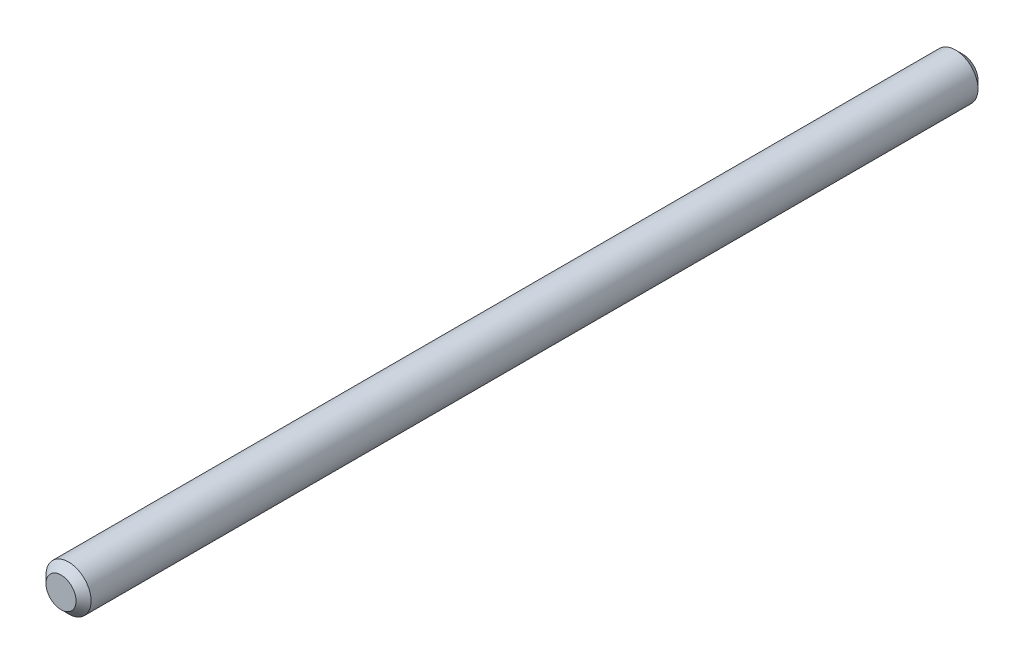
ISO-10303-21;
HEADER;
FILE_DESCRIPTION(('STEP AP214'),'2;1');
FILE_NAME('part.step','',(''),(''),'','','');
FILE_SCHEMA(('AUTOMOTIVE_DESIGN { 1 0 10303 214 1 1 1 1 }'));
ENDSEC;
DATA;
#1=APPLICATION_CONTEXT('core data for automotive mechanical design processes');
#2=APPLICATION_PROTOCOL_DEFINITION('international standard','automotive_design',2000,#1);
#3=PRODUCT_CONTEXT('',#1,'mechanical');
#4=PRODUCT('Part','Part','',(#3));
#5=PRODUCT_RELATED_PRODUCT_CATEGORY('part','',(#4));
#6=PRODUCT_DEFINITION_FORMATION('','',#4);
#7=PRODUCT_DEFINITION_CONTEXT('part definition',#1,'design');
#8=PRODUCT_DEFINITION('design','',#6,#7);
#9=PRODUCT_DEFINITION_SHAPE('','',#8);
#10=(LENGTH_UNIT() NAMED_UNIT(*) SI_UNIT(.MILLI.,.METRE.));
#11=(NAMED_UNIT(*) PLANE_ANGLE_UNIT() SI_UNIT($,.RADIAN.));
#12=(NAMED_UNIT(*) SI_UNIT($,.STERADIAN.) SOLID_ANGLE_UNIT());
#13=UNCERTAINTY_MEASURE_WITH_UNIT(LENGTH_MEASURE(1.E-05),#10,'distance_accuracy_value','');
#14=(GEOMETRIC_REPRESENTATION_CONTEXT(3) GLOBAL_UNCERTAINTY_ASSIGNED_CONTEXT((#13)) GLOBAL_UNIT_ASSIGNED_CONTEXT((#10,
#11,#12)) REPRESENTATION_CONTEXT('',''));
#15=CARTESIAN_POINT('',(0.,0.,0.));
#16=DIRECTION('',(0.,0.,1.));
#17=DIRECTION('',(1.,0.,0.));
#18=AXIS2_PLACEMENT_3D('',#15,#16,#17);
#19=CARTESIAN_POINT('',(0.,0.,30.));
#20=DIRECTION('',(0.,0.,-1.));
#21=DIRECTION('',(-1.,0.,0.));
#22=AXIS2_PLACEMENT_3D('',#19,#20,#21);
#23=CYLINDRICAL_SURFACE('',#22,1.5);
#24=CARTESIAN_POINT('',(0.,0.,-29.5));
#25=DIRECTION('',(0.,0.,1.));
#26=DIRECTION('',(1.,0.,0.));
#27=AXIS2_PLACEMENT_3D('',#24,#25,#26);
#28=CIRCLE('',#27,1.5);
#29=CARTESIAN_POINT('',(1.5,0.,-29.5));
#30=VERTEX_POINT('',#29);
#31=EDGE_CURVE('E43',#30,#30,#28,.T.);
#32=ORIENTED_EDGE('',*,*,#31,.T.);
#33=EDGE_LOOP('',(#32));
#34=FACE_BOUND('',#33,.T.);
#35=CARTESIAN_POINT('',(0.,0.,29.5));
#36=DIRECTION('',(0.,0.,1.));
#37=DIRECTION('',(1.,0.,0.));
#38=AXIS2_PLACEMENT_3D('',#35,#36,#37);
#39=CIRCLE('',#38,1.5);
#40=CARTESIAN_POINT('',(1.5,0.,29.5));
#41=VERTEX_POINT('',#40);
#42=EDGE_CURVE('E47',#41,#41,#39,.F.);
#43=ORIENTED_EDGE('',*,*,#42,.T.);
#44=EDGE_LOOP('',(#43));
#45=FACE_BOUND('',#44,.T.);
#46=ADVANCED_FACE('F32',(#34,#45),#23,.T.);
#47=CARTESIAN_POINT('',(0.,0.,30.));
#48=DIRECTION('',(0.,0.,1.));
#49=DIRECTION('',(1.,0.,0.));
#50=AXIS2_PLACEMENT_3D('',#47,#48,#49);
#51=PLANE('',#50);
#52=CARTESIAN_POINT('',(0.,0.,30.));
#53=DIRECTION('',(0.,0.,1.));
#54=DIRECTION('',(1.,0.,0.));
#55=AXIS2_PLACEMENT_3D('',#52,#53,#54);
#56=CIRCLE('',#55,1.);
#57=CARTESIAN_POINT('',(1.,0.,30.));
#58=VERTEX_POINT('',#57);
#59=EDGE_CURVE('E10',#58,#58,#56,.T.);
#60=ORIENTED_EDGE('',*,*,#59,.T.);
#61=EDGE_LOOP('',(#60));
#62=FACE_BOUND('',#61,.T.);
#63=ADVANCED_FACE('F63',(#62),#51,.T.);
#64=CARTESIAN_POINT('',(0.,0.,-30.));
#65=DIRECTION('',(0.,0.,1.));
#66=DIRECTION('',(1.,0.,0.));
#67=AXIS2_PLACEMENT_3D('',#64,#65,#66);
#68=PLANE('',#67);
#69=CARTESIAN_POINT('',(0.,0.,-30.));
#70=DIRECTION('',(0.,0.,1.));
#71=DIRECTION('',(1.,0.,0.));
#72=AXIS2_PLACEMENT_3D('',#69,#70,#71);
#73=CIRCLE('',#72,0.999999999999987);
#74=CARTESIAN_POINT('',(0.999999999999987,0.,-30.));
#75=VERTEX_POINT('',#74);
#76=EDGE_CURVE('E39',#75,#75,#73,.F.);
#77=ORIENTED_EDGE('',*,*,#76,.T.);
#78=EDGE_LOOP('',(#77));
#79=FACE_BOUND('',#78,.T.);
#80=ADVANCED_FACE('F60',(#79),#68,.F.);
#81=CARTESIAN_POINT('',(0.,0.,-29.5));
#82=DIRECTION('',(0.,0.,1.));
#83=DIRECTION('',(1.,0.,0.));
#84=AXIS2_PLACEMENT_3D('',#81,#82,#83);
#85=CONICAL_SURFACE('',#84,1.5,0.785398163397447);
#86=ORIENTED_EDGE('',*,*,#76,.F.);
#87=EDGE_LOOP('',(#86));
#88=FACE_BOUND('',#87,.T.);
#89=ORIENTED_EDGE('',*,*,#31,.F.);
#90=EDGE_LOOP('',(#89));
#91=FACE_BOUND('',#90,.T.);
#92=ADVANCED_FACE('F56',(#88,#91),#85,.T.);
#93=CARTESIAN_POINT('',(0.,0.,30.));
#94=DIRECTION('',(0.,0.,-1.));
#95=DIRECTION('',(-1.,0.,0.));
#96=AXIS2_PLACEMENT_3D('',#93,#94,#95);
#97=CONICAL_SURFACE('',#96,1.,0.78539816339745);
#98=ORIENTED_EDGE('',*,*,#42,.F.);
#99=EDGE_LOOP('',(#98));
#100=FACE_BOUND('',#99,.T.);
#101=ORIENTED_EDGE('',*,*,#59,.F.);
#102=EDGE_LOOP('',(#101));
#103=FACE_BOUND('',#102,.T.);
#104=ADVANCED_FACE('F34',(#100,#103),#97,.T.);
#105=CLOSED_SHELL('',(#46,#63,#80,#92,#104));
#106=MANIFOLD_SOLID_BREP('B2',#105);
#107=ADVANCED_BREP_SHAPE_REPRESENTATION('',(#18,#106),#14);
#108=SHAPE_DEFINITION_REPRESENTATION(#9,#107);
ENDSEC;
END-ISO-10303-21;
